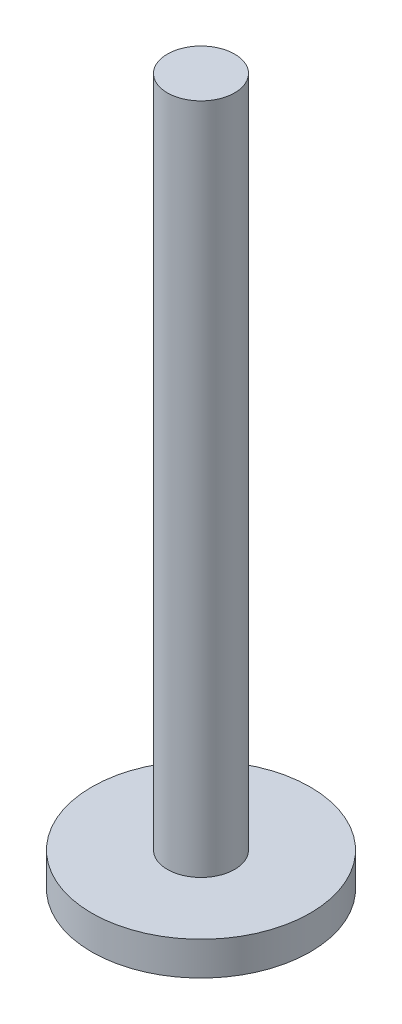
ISO-10303-21;
HEADER;
FILE_DESCRIPTION(('STEP AP214'),'2;1');
FILE_NAME('part.step','',(''),(''),'','','');
FILE_SCHEMA(('AUTOMOTIVE_DESIGN { 1 0 10303 214 1 1 1 1 }'));
ENDSEC;
DATA;
#1=APPLICATION_CONTEXT('core data for automotive mechanical design processes');
#2=APPLICATION_PROTOCOL_DEFINITION('international standard','automotive_design',2000,#1);
#3=PRODUCT_CONTEXT('',#1,'mechanical');
#4=PRODUCT('Part','Part','',(#3));
#5=PRODUCT_RELATED_PRODUCT_CATEGORY('part','',(#4));
#6=PRODUCT_DEFINITION_FORMATION('','',#4);
#7=PRODUCT_DEFINITION_CONTEXT('part definition',#1,'design');
#8=PRODUCT_DEFINITION('design','',#6,#7);
#9=PRODUCT_DEFINITION_SHAPE('','',#8);
#10=(LENGTH_UNIT() NAMED_UNIT(*) SI_UNIT(.MILLI.,.METRE.));
#11=(NAMED_UNIT(*) PLANE_ANGLE_UNIT() SI_UNIT($,.RADIAN.));
#12=(NAMED_UNIT(*) SI_UNIT($,.STERADIAN.) SOLID_ANGLE_UNIT());
#13=UNCERTAINTY_MEASURE_WITH_UNIT(LENGTH_MEASURE(1.E-05),#10,'distance_accuracy_value','');
#14=(GEOMETRIC_REPRESENTATION_CONTEXT(3) GLOBAL_UNCERTAINTY_ASSIGNED_CONTEXT((#13)) GLOBAL_UNIT_ASSIGNED_CONTEXT((#10,
#11,#12)) REPRESENTATION_CONTEXT('',''));
#15=CARTESIAN_POINT('',(0.,0.,0.));
#16=DIRECTION('',(0.,0.,1.));
#17=DIRECTION('',(1.,0.,0.));
#18=AXIS2_PLACEMENT_3D('',#15,#16,#17);
#19=CARTESIAN_POINT('',(0.,12.7,0.));
#20=DIRECTION('',(0.,-1.,0.));
#21=DIRECTION('',(0.,0.,-1.));
#22=AXIS2_PLACEMENT_3D('',#19,#20,#21);
#23=CYLINDRICAL_SURFACE('',#22,41.275);
#24=CARTESIAN_POINT('',(0.,12.7,0.));
#25=DIRECTION('',(0.,1.,0.));
#26=DIRECTION('',(0.,0.,1.));
#27=AXIS2_PLACEMENT_3D('',#24,#25,#26);
#28=CIRCLE('',#27,41.275);
#29=CARTESIAN_POINT('',(0.,12.7,41.275));
#30=VERTEX_POINT('',#29);
#31=EDGE_CURVE('E38',#30,#30,#28,.T.);
#32=ORIENTED_EDGE('',*,*,#31,.F.);
#33=EDGE_LOOP('',(#32));
#34=FACE_BOUND('',#33,.T.);
#35=CARTESIAN_POINT('',(0.,0.,0.));
#36=DIRECTION('',(0.,1.,0.));
#37=DIRECTION('',(0.,0.,1.));
#38=AXIS2_PLACEMENT_3D('',#35,#36,#37);
#39=CIRCLE('',#38,41.275);
#40=CARTESIAN_POINT('',(0.,0.,41.275));
#41=VERTEX_POINT('',#40);
#42=EDGE_CURVE('E34',#41,#41,#39,.T.);
#43=ORIENTED_EDGE('',*,*,#42,.T.);
#44=EDGE_LOOP('',(#43));
#45=FACE_BOUND('',#44,.T.);
#46=ADVANCED_FACE('F31',(#34,#45),#23,.T.);
#47=CARTESIAN_POINT('',(0.,12.7,0.));
#48=DIRECTION('',(0.,1.,0.));
#49=DIRECTION('',(0.,0.,1.));
#50=AXIS2_PLACEMENT_3D('',#47,#48,#49);
#51=PLANE('',#50);
#52=CARTESIAN_POINT('',(0.,12.7,0.));
#53=DIRECTION('',(0.,1.,0.));
#54=DIRECTION('',(0.,0.,1.));
#55=AXIS2_PLACEMENT_3D('',#52,#53,#54);
#56=CIRCLE('',#55,12.7);
#57=CARTESIAN_POINT('',(0.,12.7,12.7));
#58=VERTEX_POINT('',#57);
#59=EDGE_CURVE('E10',#58,#58,#56,.T.);
#60=ORIENTED_EDGE('',*,*,#59,.F.);
#61=EDGE_LOOP('',(#60));
#62=FACE_BOUND('',#61,.T.);
#63=ORIENTED_EDGE('',*,*,#31,.T.);
#64=EDGE_LOOP('',(#63));
#65=FACE_BOUND('',#64,.T.);
#66=ADVANCED_FACE('F55',(#62,#65),#51,.T.);
#67=CARTESIAN_POINT('',(0.,0.,0.));
#68=DIRECTION('',(0.,1.,0.));
#69=DIRECTION('',(0.,0.,1.));
#70=AXIS2_PLACEMENT_3D('',#67,#68,#69);
#71=PLANE('',#70);
#72=ORIENTED_EDGE('',*,*,#42,.F.);
#73=EDGE_LOOP('',(#72));
#74=FACE_BOUND('',#73,.T.);
#75=ADVANCED_FACE('F52',(#74),#71,.F.);
#76=CARTESIAN_POINT('',(0.,266.7,0.));
#77=DIRECTION('',(0.,-1.,0.));
#78=DIRECTION('',(0.,0.,-1.));
#79=AXIS2_PLACEMENT_3D('',#76,#77,#78);
#80=CYLINDRICAL_SURFACE('',#79,12.7);
#81=CARTESIAN_POINT('',(0.,266.7,0.));
#82=DIRECTION('',(0.,1.,0.));
#83=DIRECTION('',(0.,0.,1.));
#84=AXIS2_PLACEMENT_3D('',#81,#82,#83);
#85=CIRCLE('',#84,12.7);
#86=CARTESIAN_POINT('',(0.,266.7,12.7));
#87=VERTEX_POINT('',#86);
#88=EDGE_CURVE('E44',#87,#87,#85,.T.);
#89=ORIENTED_EDGE('',*,*,#88,.F.);
#90=EDGE_LOOP('',(#89));
#91=FACE_BOUND('',#90,.T.);
#92=ORIENTED_EDGE('',*,*,#59,.T.);
#93=EDGE_LOOP('',(#92));
#94=FACE_BOUND('',#93,.T.);
#95=ADVANCED_FACE('F54',(#91,#94),#80,.T.);
#96=CARTESIAN_POINT('',(0.,266.7,0.));
#97=DIRECTION('',(0.,1.,0.));
#98=DIRECTION('',(0.,0.,1.));
#99=AXIS2_PLACEMENT_3D('',#96,#97,#98);
#100=PLANE('',#99);
#101=ORIENTED_EDGE('',*,*,#88,.T.);
#102=EDGE_LOOP('',(#101));
#103=FACE_BOUND('',#102,.T.);
#104=ADVANCED_FACE('F60',(#103),#100,.T.);
#105=CLOSED_SHELL('',(#46,#66,#75,#95,#104));
#106=MANIFOLD_SOLID_BREP('B2',#105);
#107=ADVANCED_BREP_SHAPE_REPRESENTATION('',(#18,#106),#14);
#108=SHAPE_DEFINITION_REPRESENTATION(#9,#107);
ENDSEC;
END-ISO-10303-21;
